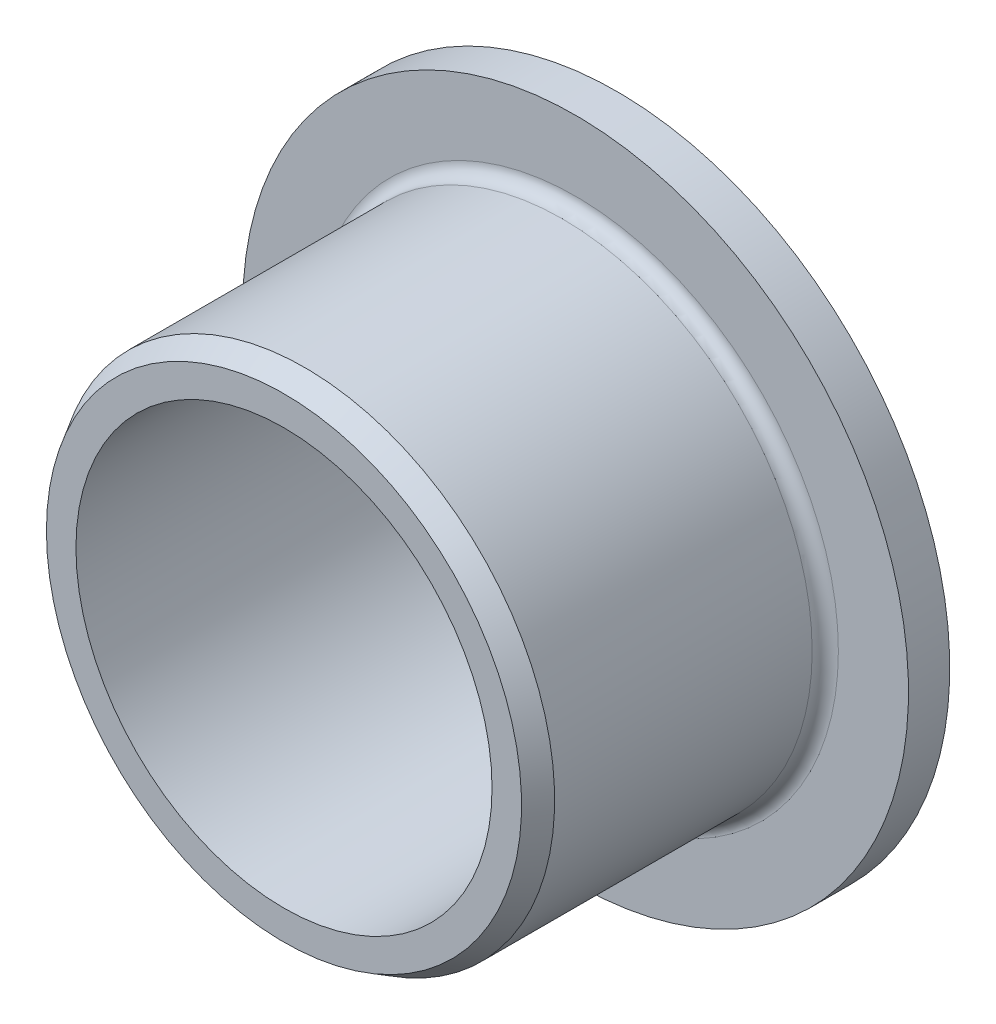
ISO-10303-21;
HEADER;
FILE_DESCRIPTION(('STEP AP214'),'2;1');
FILE_NAME('part.step','',(''),(''),'','','');
FILE_SCHEMA(('AUTOMOTIVE_DESIGN { 1 0 10303 214 1 1 1 1 }'));
ENDSEC;
DATA;
#1=APPLICATION_CONTEXT('core data for automotive mechanical design processes');
#2=APPLICATION_PROTOCOL_DEFINITION('international standard','automotive_design',2000,#1);
#3=PRODUCT_CONTEXT('',#1,'mechanical');
#4=PRODUCT('Part','Part','',(#3));
#5=PRODUCT_RELATED_PRODUCT_CATEGORY('part','',(#4));
#6=PRODUCT_DEFINITION_FORMATION('','',#4);
#7=PRODUCT_DEFINITION_CONTEXT('part definition',#1,'design');
#8=PRODUCT_DEFINITION('design','',#6,#7);
#9=PRODUCT_DEFINITION_SHAPE('','',#8);
#10=(LENGTH_UNIT() NAMED_UNIT(*) SI_UNIT(.MILLI.,.METRE.));
#11=(NAMED_UNIT(*) PLANE_ANGLE_UNIT() SI_UNIT($,.RADIAN.));
#12=(NAMED_UNIT(*) SI_UNIT($,.STERADIAN.) SOLID_ANGLE_UNIT());
#13=UNCERTAINTY_MEASURE_WITH_UNIT(LENGTH_MEASURE(1.E-05),#10,'distance_accuracy_value','');
#14=(GEOMETRIC_REPRESENTATION_CONTEXT(3) GLOBAL_UNCERTAINTY_ASSIGNED_CONTEXT((#13)) GLOBAL_UNIT_ASSIGNED_CONTEXT((#10,
#11,#12)) REPRESENTATION_CONTEXT('',''));
#15=CARTESIAN_POINT('',(0.,0.,0.));
#16=DIRECTION('',(0.,0.,1.));
#17=DIRECTION('',(1.,0.,0.));
#18=AXIS2_PLACEMENT_3D('',#15,#16,#17);
#19=CARTESIAN_POINT('',(0.,0.,2.07480000000001));
#20=DIRECTION('',(0.,0.,1.));
#21=DIRECTION('',(1.,0.,0.));
#22=AXIS2_PLACEMENT_3D('',#19,#20,#21);
#23=TOROIDAL_SURFACE('',#22,10.025,0.50000000000001);
#24=CARTESIAN_POINT('',(0.,0.,1.5748));
#25=DIRECTION('',(0.,0.,1.));
#26=DIRECTION('',(1.,0.,0.));
#27=AXIS2_PLACEMENT_3D('',#24,#25,#26);
#28=CIRCLE('',#27,10.025);
#29=CARTESIAN_POINT('',(10.025,0.,1.5748));
#30=VERTEX_POINT('',#29);
#31=EDGE_CURVE('E19',#30,#30,#28,.F.);
#32=ORIENTED_EDGE('',*,*,#31,.F.);
#33=EDGE_LOOP('',(#32));
#34=FACE_BOUND('',#33,.T.);
#35=CARTESIAN_POINT('',(0.,0.,2.07480000000001));
#36=DIRECTION('',(0.,0.,-1.));
#37=DIRECTION('',(-1.,0.,0.));
#38=AXIS2_PLACEMENT_3D('',#35,#36,#37);
#39=CIRCLE('',#38,9.525);
#40=CARTESIAN_POINT('',(-9.525,0.,2.07480000000001));
#41=VERTEX_POINT('',#40);
#42=EDGE_CURVE('E41',#41,#41,#39,.F.);
#43=ORIENTED_EDGE('',*,*,#42,.F.);
#44=EDGE_LOOP('',(#43));
#45=FACE_BOUND('',#44,.T.);
#46=ADVANCED_FACE('F15',(#34,#45),#23,.F.);
#47=CARTESIAN_POINT('',(-12.7,-12.7,1.5748));
#48=DIRECTION('',(0.,0.,1.));
#49=DIRECTION('',(1.,0.,0.));
#50=AXIS2_PLACEMENT_3D('',#47,#48,#49);
#51=PLANE('',#50);
#52=ORIENTED_EDGE('',*,*,#31,.T.);
#53=EDGE_LOOP('',(#52));
#54=FACE_BOUND('',#53,.T.);
#55=CARTESIAN_POINT('',(0.,0.,1.5748));
#56=DIRECTION('',(0.,0.,-1.));
#57=DIRECTION('',(-1.,0.,0.));
#58=AXIS2_PLACEMENT_3D('',#55,#56,#57);
#59=CIRCLE('',#58,12.7);
#60=CARTESIAN_POINT('',(-12.7,0.,1.5748));
#61=VERTEX_POINT('',#60);
#62=EDGE_CURVE('E39',#61,#61,#59,.T.);
#63=ORIENTED_EDGE('',*,*,#62,.F.);
#64=EDGE_LOOP('',(#63));
#65=FACE_BOUND('',#64,.T.);
#66=ADVANCED_FACE('F48',(#54,#65),#51,.T.);
#67=CARTESIAN_POINT('',(0.,0.,11.9));
#68=DIRECTION('',(0.,0.,-1.));
#69=DIRECTION('',(-1.,0.,0.));
#70=AXIS2_PLACEMENT_3D('',#67,#68,#69);
#71=CYLINDRICAL_SURFACE('',#70,9.525);
#72=CARTESIAN_POINT('',(0.,0.,11.9));
#73=DIRECTION('',(0.,0.,-1.));
#74=DIRECTION('',(-1.,0.,0.));
#75=AXIS2_PLACEMENT_3D('',#72,#73,#74);
#76=CIRCLE('',#75,9.525);
#77=CARTESIAN_POINT('',(-9.525,0.,11.9));
#78=VERTEX_POINT('',#77);
#79=EDGE_CURVE('E36',#78,#78,#76,.F.);
#80=ORIENTED_EDGE('',*,*,#79,.F.);
#81=EDGE_LOOP('',(#80));
#82=FACE_BOUND('',#81,.T.);
#83=ORIENTED_EDGE('',*,*,#42,.T.);
#84=EDGE_LOOP('',(#83));
#85=FACE_BOUND('',#84,.T.);
#86=ADVANCED_FACE('F58',(#82,#85),#71,.T.);
#87=CARTESIAN_POINT('',(0.,0.,1.5748));
#88=DIRECTION('',(0.,0.,-1.));
#89=DIRECTION('',(-1.,0.,0.));
#90=AXIS2_PLACEMENT_3D('',#87,#88,#89);
#91=CYLINDRICAL_SURFACE('',#90,12.7);
#92=ORIENTED_EDGE('',*,*,#62,.T.);
#93=EDGE_LOOP('',(#92));
#94=FACE_BOUND('',#93,.T.);
#95=CARTESIAN_POINT('',(0.,0.,0.));
#96=DIRECTION('',(0.,0.,-1.));
#97=DIRECTION('',(-1.,0.,0.));
#98=AXIS2_PLACEMENT_3D('',#95,#96,#97);
#99=CIRCLE('',#98,12.7);
#100=CARTESIAN_POINT('',(-12.7,0.,0.));
#101=VERTEX_POINT('',#100);
#102=EDGE_CURVE('E33',#101,#101,#99,.T.);
#103=ORIENTED_EDGE('',*,*,#102,.F.);
#104=EDGE_LOOP('',(#103));
#105=FACE_BOUND('',#104,.T.);
#106=ADVANCED_FACE('F76',(#94,#105),#91,.T.);
#107=CARTESIAN_POINT('',(0.,0.,12.7));
#108=DIRECTION('',(0.,0.,-1.));
#109=DIRECTION('',(-1.,0.,0.));
#110=AXIS2_PLACEMENT_3D('',#107,#108,#109);
#111=CONICAL_SURFACE('',#110,9.0631197846483,0.523598775598299);
#112=CARTESIAN_POINT('',(0.,0.,12.7));
#113=DIRECTION('',(0.,0.,-1.));
#114=DIRECTION('',(-1.,0.,0.));
#115=AXIS2_PLACEMENT_3D('',#112,#113,#114);
#116=CIRCLE('',#115,9.0631197846483);
#117=CARTESIAN_POINT('',(-9.0631197846483,0.,12.7));
#118=VERTEX_POINT('',#117);
#119=EDGE_CURVE('E28',#118,#118,#116,.F.);
#120=ORIENTED_EDGE('',*,*,#119,.F.);
#121=EDGE_LOOP('',(#120));
#122=FACE_BOUND('',#121,.T.);
#123=ORIENTED_EDGE('',*,*,#79,.T.);
#124=EDGE_LOOP('',(#123));
#125=FACE_BOUND('',#124,.T.);
#126=ADVANCED_FACE('F72',(#122,#125),#111,.T.);
#127=CARTESIAN_POINT('',(12.7,-12.7,0.));
#128=DIRECTION('',(0.,0.,-1.));
#129=DIRECTION('',(-1.,0.,0.));
#130=AXIS2_PLACEMENT_3D('',#127,#128,#129);
#131=PLANE('',#130);
#132=CARTESIAN_POINT('',(0.,0.,0.));
#133=DIRECTION('',(0.,0.,1.));
#134=DIRECTION('',(1.,0.,0.));
#135=AXIS2_PLACEMENT_3D('',#132,#133,#134);
#136=CIRCLE('',#135,7.9375);
#137=CARTESIAN_POINT('',(7.9375,0.,0.));
#138=VERTEX_POINT('',#137);
#139=EDGE_CURVE('E23',#138,#138,#136,.F.);
#140=ORIENTED_EDGE('',*,*,#139,.F.);
#141=EDGE_LOOP('',(#140));
#142=FACE_BOUND('',#141,.T.);
#143=ORIENTED_EDGE('',*,*,#102,.T.);
#144=EDGE_LOOP('',(#143));
#145=FACE_BOUND('',#144,.T.);
#146=ADVANCED_FACE('F66',(#142,#145),#131,.T.);
#147=CARTESIAN_POINT('',(-9.0631197846483,-9.0631197846483,12.7));
#148=DIRECTION('',(0.,0.,1.));
#149=DIRECTION('',(1.,0.,0.));
#150=AXIS2_PLACEMENT_3D('',#147,#148,#149);
#151=PLANE('',#150);
#152=CARTESIAN_POINT('',(0.,0.,12.7));
#153=DIRECTION('',(0.,0.,1.));
#154=DIRECTION('',(1.,0.,0.));
#155=AXIS2_PLACEMENT_3D('',#152,#153,#154);
#156=CIRCLE('',#155,7.9375);
#157=CARTESIAN_POINT('',(7.9375,0.,12.7));
#158=VERTEX_POINT('',#157);
#159=EDGE_CURVE('E10',#158,#158,#156,.T.);
#160=ORIENTED_EDGE('',*,*,#159,.F.);
#161=EDGE_LOOP('',(#160));
#162=FACE_BOUND('',#161,.T.);
#163=ORIENTED_EDGE('',*,*,#119,.T.);
#164=EDGE_LOOP('',(#163));
#165=FACE_BOUND('',#164,.T.);
#166=ADVANCED_FACE('F61',(#162,#165),#151,.T.);
#167=CARTESIAN_POINT('',(0.,0.,0.));
#168=DIRECTION('',(0.,0.,1.));
#169=DIRECTION('',(1.,0.,0.));
#170=AXIS2_PLACEMENT_3D('',#167,#168,#169);
#171=CYLINDRICAL_SURFACE('',#170,7.9375);
#172=ORIENTED_EDGE('',*,*,#139,.T.);
#173=EDGE_LOOP('',(#172));
#174=FACE_BOUND('',#173,.T.);
#175=ORIENTED_EDGE('',*,*,#159,.T.);
#176=EDGE_LOOP('',(#175));
#177=FACE_BOUND('',#176,.T.);
#178=ADVANCED_FACE('F17',(#174,#177),#171,.F.);
#179=CLOSED_SHELL('',(#46,#66,#86,#106,#126,#146,#166,#178));
#180=MANIFOLD_SOLID_BREP('B1',#179);
#181=ADVANCED_BREP_SHAPE_REPRESENTATION('',(#18,#180),#14);
#182=SHAPE_DEFINITION_REPRESENTATION(#9,#181);
ENDSEC;
END-ISO-10303-21;
